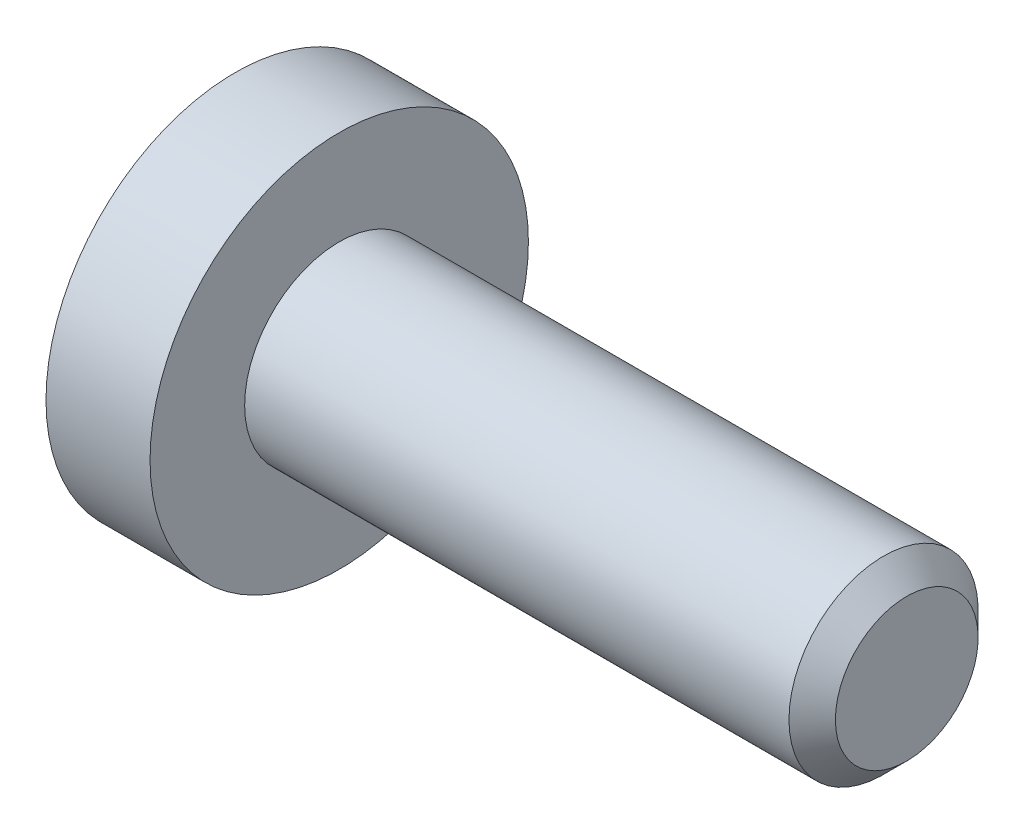
ISO-10303-21;
HEADER;
FILE_DESCRIPTION(('STEP AP214'),'2;1');
FILE_NAME('part.step','',(''),(''),'','','');
FILE_SCHEMA(('AUTOMOTIVE_DESIGN { 1 0 10303 214 1 1 1 1 }'));
ENDSEC;
DATA;
#1=APPLICATION_CONTEXT('core data for automotive mechanical design processes');
#2=APPLICATION_PROTOCOL_DEFINITION('international standard','automotive_design',2000,#1);
#3=PRODUCT_CONTEXT('',#1,'mechanical');
#4=PRODUCT('Part','Part','',(#3));
#5=PRODUCT_RELATED_PRODUCT_CATEGORY('part','',(#4));
#6=PRODUCT_DEFINITION_FORMATION('','',#4);
#7=PRODUCT_DEFINITION_CONTEXT('part definition',#1,'design');
#8=PRODUCT_DEFINITION('design','',#6,#7);
#9=PRODUCT_DEFINITION_SHAPE('','',#8);
#10=(LENGTH_UNIT() NAMED_UNIT(*) SI_UNIT(.MILLI.,.METRE.));
#11=(NAMED_UNIT(*) PLANE_ANGLE_UNIT() SI_UNIT($,.RADIAN.));
#12=(NAMED_UNIT(*) SI_UNIT($,.STERADIAN.) SOLID_ANGLE_UNIT());
#13=UNCERTAINTY_MEASURE_WITH_UNIT(LENGTH_MEASURE(1.E-05),#10,'distance_accuracy_value','');
#14=(GEOMETRIC_REPRESENTATION_CONTEXT(3) GLOBAL_UNCERTAINTY_ASSIGNED_CONTEXT((#13)) GLOBAL_UNIT_ASSIGNED_CONTEXT((#10,
#11,#12)) REPRESENTATION_CONTEXT('',''));
#15=CARTESIAN_POINT('',(0.,0.,0.));
#16=DIRECTION('',(0.,0.,1.));
#17=DIRECTION('',(1.,0.,0.));
#18=AXIS2_PLACEMENT_3D('',#15,#16,#17);
#19=CARTESIAN_POINT('',(-1.1,0.,0.));
#20=DIRECTION('',(1.,0.,0.));
#21=DIRECTION('',(0.,0.,-1.));
#22=AXIS2_PLACEMENT_3D('',#19,#20,#21);
#23=PLANE('',#22);
#24=CARTESIAN_POINT('',(-1.1,0.,0.));
#25=DIRECTION('',(-1.,0.,0.));
#26=DIRECTION('',(0.,0.,1.));
#27=AXIS2_PLACEMENT_3D('',#24,#25,#26);
#28=CIRCLE('',#27,2.);
#29=CARTESIAN_POINT('',(-1.1,0.,2.));
#30=VERTEX_POINT('',#29);
#31=EDGE_CURVE('E11',#30,#30,#28,.T.);
#32=ORIENTED_EDGE('',*,*,#31,.T.);
#33=EDGE_LOOP('',(#32));
#34=FACE_BOUND('',#33,.T.);
#35=DIRECTION('',(0.,-1.,0.));
#36=VECTOR('',#35,1.);
#37=CARTESIAN_POINT('',(-1.1,0.37527767497326,0.65));
#38=LINE('',#37,#36);
#39=CARTESIAN_POINT('',(-1.1,0.37527767497326,0.65));
#40=VERTEX_POINT('',#39);
#41=CARTESIAN_POINT('',(-1.1,-0.37527767497326,0.65));
#42=VERTEX_POINT('',#41);
#43=EDGE_CURVE('E52',#40,#42,#38,.T.);
#44=ORIENTED_EDGE('',*,*,#43,.T.);
#45=DIRECTION('',(0.,-0.499999999999993,-0.866025403784442));
#46=VECTOR('',#45,1.);
#47=CARTESIAN_POINT('',(-1.1,-0.37527767497326,0.65));
#48=LINE('',#47,#46);
#49=CARTESIAN_POINT('',(-1.1,-0.75055534994651,0.));
#50=VERTEX_POINT('',#49);
#51=EDGE_CURVE('E123',#42,#50,#48,.T.);
#52=ORIENTED_EDGE('',*,*,#51,.T.);
#53=DIRECTION('',(0.,0.499999999999993,-0.866025403784442));
#54=VECTOR('',#53,1.);
#55=CARTESIAN_POINT('',(-1.1,-0.75055534994651,0.));
#56=LINE('',#55,#54);
#57=CARTESIAN_POINT('',(-1.1,-0.37527767497326,-0.65));
#58=VERTEX_POINT('',#57);
#59=EDGE_CURVE('E126',#50,#58,#56,.T.);
#60=ORIENTED_EDGE('',*,*,#59,.T.);
#61=DIRECTION('',(0.,1.,0.));
#62=VECTOR('',#61,1.);
#63=CARTESIAN_POINT('',(-1.1,-0.37527767497326,-0.65));
#64=LINE('',#63,#62);
#65=CARTESIAN_POINT('',(-1.1,0.37527767497326,-0.65));
#66=VERTEX_POINT('',#65);
#67=EDGE_CURVE('E129',#58,#66,#64,.T.);
#68=ORIENTED_EDGE('',*,*,#67,.T.);
#69=DIRECTION('',(0.,0.499999999999993,0.866025403784442));
#70=VECTOR('',#69,1.);
#71=CARTESIAN_POINT('',(-1.1,0.37527767497326,-0.65));
#72=LINE('',#71,#70);
#73=CARTESIAN_POINT('',(-1.1,0.75055534994651,0.));
#74=VERTEX_POINT('',#73);
#75=EDGE_CURVE('E113',#66,#74,#72,.T.);
#76=ORIENTED_EDGE('',*,*,#75,.T.);
#77=DIRECTION('',(0.,-0.499999999999993,0.866025403784442));
#78=VECTOR('',#77,1.);
#79=CARTESIAN_POINT('',(-1.1,0.75055534994651,0.));
#80=LINE('',#79,#78);
#81=EDGE_CURVE('E132',#74,#40,#80,.T.);
#82=ORIENTED_EDGE('',*,*,#81,.T.);
#83=EDGE_LOOP('',(#44,#52,#60,#68,#76,#82));
#84=FACE_BOUND('',#83,.T.);
#85=ADVANCED_FACE('F38',(#34,#84),#23,.F.);
#86=CARTESIAN_POINT('',(6.,0.,0.));
#87=DIRECTION('',(-1.,0.,0.));
#88=DIRECTION('',(0.,0.,1.));
#89=AXIS2_PLACEMENT_3D('',#86,#87,#88);
#90=CYLINDRICAL_SURFACE('',#89,2.);
#91=ORIENTED_EDGE('',*,*,#31,.F.);
#92=EDGE_LOOP('',(#91));
#93=FACE_BOUND('',#92,.T.);
#94=CARTESIAN_POINT('',(0.,0.,0.));
#95=DIRECTION('',(-1.,0.,0.));
#96=DIRECTION('',(0.,0.,1.));
#97=AXIS2_PLACEMENT_3D('',#94,#95,#96);
#98=CIRCLE('',#97,2.);
#99=CARTESIAN_POINT('',(0.,0.,2.));
#100=VERTEX_POINT('',#99);
#101=EDGE_CURVE('E45',#100,#100,#98,.T.);
#102=ORIENTED_EDGE('',*,*,#101,.T.);
#103=EDGE_LOOP('',(#102));
#104=FACE_BOUND('',#103,.T.);
#105=ADVANCED_FACE('F154',(#93,#104),#90,.T.);
#106=CARTESIAN_POINT('',(0.,2.,0.));
#107=DIRECTION('',(-1.,0.,0.));
#108=DIRECTION('',(0.,0.,1.));
#109=AXIS2_PLACEMENT_3D('',#106,#107,#108);
#110=PLANE('',#109);
#111=ORIENTED_EDGE('',*,*,#101,.F.);
#112=EDGE_LOOP('',(#111));
#113=FACE_BOUND('',#112,.T.);
#114=CARTESIAN_POINT('',(0.,0.,0.));
#115=DIRECTION('',(-1.,0.,0.));
#116=DIRECTION('',(0.,0.,1.));
#117=AXIS2_PLACEMENT_3D('',#114,#115,#116);
#118=CIRCLE('',#117,1.);
#119=CARTESIAN_POINT('',(0.,0.,1.));
#120=VERTEX_POINT('',#119);
#121=EDGE_CURVE('E149',#120,#120,#118,.T.);
#122=ORIENTED_EDGE('',*,*,#121,.T.);
#123=EDGE_LOOP('',(#122));
#124=FACE_BOUND('',#123,.T.);
#125=ADVANCED_FACE('F156',(#113,#124),#110,.F.);
#126=CARTESIAN_POINT('',(6.,0.,0.));
#127=DIRECTION('',(-1.,0.,0.));
#128=DIRECTION('',(0.,0.,1.));
#129=AXIS2_PLACEMENT_3D('',#126,#127,#128);
#130=CYLINDRICAL_SURFACE('',#129,1.);
#131=ORIENTED_EDGE('',*,*,#121,.F.);
#132=EDGE_LOOP('',(#131));
#133=FACE_BOUND('',#132,.T.);
#134=CARTESIAN_POINT('',(5.7545,0.,0.));
#135=DIRECTION('',(-1.,0.,0.));
#136=DIRECTION('',(0.,0.,1.));
#137=AXIS2_PLACEMENT_3D('',#134,#135,#136);
#138=CIRCLE('',#137,1.);
#139=CARTESIAN_POINT('',(5.7545,0.,1.));
#140=VERTEX_POINT('',#139);
#141=EDGE_CURVE('E146',#140,#140,#138,.T.);
#142=ORIENTED_EDGE('',*,*,#141,.T.);
#143=EDGE_LOOP('',(#142));
#144=FACE_BOUND('',#143,.T.);
#145=ADVANCED_FACE('F159',(#133,#144),#130,.T.);
#146=CARTESIAN_POINT('',(6.,0.,0.));
#147=DIRECTION('',(-1.,0.,0.));
#148=DIRECTION('',(0.,0.,1.));
#149=AXIS2_PLACEMENT_3D('',#146,#147,#148);
#150=CONICAL_SURFACE('',#149,0.7545,0.785398163397448);
#151=ORIENTED_EDGE('',*,*,#141,.F.);
#152=EDGE_LOOP('',(#151));
#153=FACE_BOUND('',#152,.T.);
#154=CARTESIAN_POINT('',(6.,0.,0.));
#155=DIRECTION('',(-1.,0.,0.));
#156=DIRECTION('',(0.,0.,1.));
#157=AXIS2_PLACEMENT_3D('',#154,#155,#156);
#158=CIRCLE('',#157,0.7545);
#159=CARTESIAN_POINT('',(6.,0.,0.7545));
#160=VERTEX_POINT('',#159);
#161=EDGE_CURVE('E143',#160,#160,#158,.T.);
#162=ORIENTED_EDGE('',*,*,#161,.T.);
#163=EDGE_LOOP('',(#162));
#164=FACE_BOUND('',#163,.T.);
#165=ADVANCED_FACE('F165',(#153,#164),#150,.T.);
#166=CARTESIAN_POINT('',(6.,0.7545,0.));
#167=DIRECTION('',(-1.,0.,0.));
#168=DIRECTION('',(0.,0.,1.));
#169=AXIS2_PLACEMENT_3D('',#166,#167,#168);
#170=PLANE('',#169);
#171=ORIENTED_EDGE('',*,*,#161,.F.);
#172=EDGE_LOOP('',(#171));
#173=FACE_BOUND('',#172,.T.);
#174=ADVANCED_FACE('F171',(#173),#170,.F.);
#175=CARTESIAN_POINT('',(0.0999999999999998,0.37527767497326,0.65));
#176=DIRECTION('',(0.,0.,-1.));
#177=DIRECTION('',(-1.,0.,0.));
#178=AXIS2_PLACEMENT_3D('',#175,#176,#177);
#179=PLANE('',#178);
#180=ORIENTED_EDGE('',*,*,#43,.F.);
#181=DIRECTION('',(-1.,0.,0.));
#182=VECTOR('',#181,1.);
#183=CARTESIAN_POINT('',(0.0999999999999998,0.37527767497326,0.65));
#184=LINE('',#183,#182);
#185=CARTESIAN_POINT('',(0.0999999999999998,0.37527767497326,0.65));
#186=VERTEX_POINT('',#185);
#187=EDGE_CURVE('E118',#186,#40,#184,.T.);
#188=ORIENTED_EDGE('',*,*,#187,.F.);
#189=DIRECTION('',(0.,-1.,0.));
#190=VECTOR('',#189,1.);
#191=CARTESIAN_POINT('',(0.0999999999999998,0.37527767497326,0.65));
#192=LINE('',#191,#190);
#193=CARTESIAN_POINT('',(0.0999999999999998,-0.37527767497326,0.65));
#194=VERTEX_POINT('',#193);
#195=EDGE_CURVE('E135',#186,#194,#192,.T.);
#196=ORIENTED_EDGE('',*,*,#195,.T.);
#197=DIRECTION('',(-1.,0.,0.));
#198=VECTOR('',#197,1.);
#199=CARTESIAN_POINT('',(0.0999999999999998,-0.37527767497326,0.65));
#200=LINE('',#199,#198);
#201=EDGE_CURVE('E141',#194,#42,#200,.T.);
#202=ORIENTED_EDGE('',*,*,#201,.T.);
#203=EDGE_LOOP('',(#180,#188,#196,#202));
#204=FACE_BOUND('',#203,.T.);
#205=ADVANCED_FACE('F176',(#204),#179,.T.);
#206=CARTESIAN_POINT('',(0.0999999999999998,-0.37527767497326,0.65));
#207=DIRECTION('',(0.,0.866025403784443,-0.499999999999993));
#208=DIRECTION('',(0.,0.499999999999993,0.866025403784442));
#209=AXIS2_PLACEMENT_3D('',#206,#207,#208);
#210=PLANE('',#209);
#211=ORIENTED_EDGE('',*,*,#51,.F.);
#212=ORIENTED_EDGE('',*,*,#201,.F.);
#213=DIRECTION('',(0.,-0.499999999999993,-0.866025403784442));
#214=VECTOR('',#213,1.);
#215=CARTESIAN_POINT('',(0.0999999999999998,-0.37527767497326,0.65));
#216=LINE('',#215,#214);
#217=CARTESIAN_POINT('',(0.0999999999999998,-0.75055534994651,0.));
#218=VERTEX_POINT('',#217);
#219=EDGE_CURVE('E91',#194,#218,#216,.T.);
#220=ORIENTED_EDGE('',*,*,#219,.T.);
#221=DIRECTION('',(-1.,0.,0.));
#222=VECTOR('',#221,1.);
#223=CARTESIAN_POINT('',(0.0999999999999998,-0.75055534994651,0.));
#224=LINE('',#223,#222);
#225=EDGE_CURVE('E139',#218,#50,#224,.T.);
#226=ORIENTED_EDGE('',*,*,#225,.T.);
#227=EDGE_LOOP('',(#211,#212,#220,#226));
#228=FACE_BOUND('',#227,.T.);
#229=ADVANCED_FACE('F181',(#228),#210,.T.);
#230=CARTESIAN_POINT('',(0.0999999999999998,-0.75055534994651,0.));
#231=DIRECTION('',(0.,0.866025403784443,0.499999999999993));
#232=DIRECTION('',(0.,-0.499999999999993,0.866025403784442));
#233=AXIS2_PLACEMENT_3D('',#230,#231,#232);
#234=PLANE('',#233);
#235=ORIENTED_EDGE('',*,*,#59,.F.);
#236=ORIENTED_EDGE('',*,*,#225,.F.);
#237=DIRECTION('',(0.,0.499999999999993,-0.866025403784442));
#238=VECTOR('',#237,1.);
#239=CARTESIAN_POINT('',(0.0999999999999998,-0.75055534994651,0.));
#240=LINE('',#239,#238);
#241=CARTESIAN_POINT('',(0.0999999999999998,-0.37527767497326,-0.65));
#242=VERTEX_POINT('',#241);
#243=EDGE_CURVE('E109',#218,#242,#240,.T.);
#244=ORIENTED_EDGE('',*,*,#243,.T.);
#245=DIRECTION('',(-1.,0.,0.));
#246=VECTOR('',#245,1.);
#247=CARTESIAN_POINT('',(0.0999999999999998,-0.37527767497326,-0.65));
#248=LINE('',#247,#246);
#249=EDGE_CURVE('E106',#242,#58,#248,.T.);
#250=ORIENTED_EDGE('',*,*,#249,.T.);
#251=EDGE_LOOP('',(#235,#236,#244,#250));
#252=FACE_BOUND('',#251,.T.);
#253=ADVANCED_FACE('F198',(#252),#234,.T.);
#254=CARTESIAN_POINT('',(0.0999999999999998,-0.37527767497326,-0.65));
#255=DIRECTION('',(0.,0.,1.));
#256=DIRECTION('',(1.,0.,0.));
#257=AXIS2_PLACEMENT_3D('',#254,#255,#256);
#258=PLANE('',#257);
#259=ORIENTED_EDGE('',*,*,#67,.F.);
#260=ORIENTED_EDGE('',*,*,#249,.F.);
#261=DIRECTION('',(0.,1.,0.));
#262=VECTOR('',#261,1.);
#263=CARTESIAN_POINT('',(0.0999999999999998,-0.37527767497326,-0.65));
#264=LINE('',#263,#262);
#265=CARTESIAN_POINT('',(0.0999999999999998,0.37527767497326,-0.65));
#266=VERTEX_POINT('',#265);
#267=EDGE_CURVE('E101',#242,#266,#264,.T.);
#268=ORIENTED_EDGE('',*,*,#267,.T.);
#269=DIRECTION('',(-1.,0.,0.));
#270=VECTOR('',#269,1.);
#271=CARTESIAN_POINT('',(0.0999999999999998,0.37527767497326,-0.65));
#272=LINE('',#271,#270);
#273=EDGE_CURVE('E105',#266,#66,#272,.T.);
#274=ORIENTED_EDGE('',*,*,#273,.T.);
#275=EDGE_LOOP('',(#259,#260,#268,#274));
#276=FACE_BOUND('',#275,.T.);
#277=ADVANCED_FACE('F104',(#276),#258,.T.);
#278=CARTESIAN_POINT('',(0.0999999999999998,0.37527767497326,-0.65));
#279=DIRECTION('',(0.,-0.866025403784443,0.499999999999993));
#280=DIRECTION('',(0.,-0.499999999999993,-0.866025403784442));
#281=AXIS2_PLACEMENT_3D('',#278,#279,#280);
#282=PLANE('',#281);
#283=ORIENTED_EDGE('',*,*,#75,.F.);
#284=ORIENTED_EDGE('',*,*,#273,.F.);
#285=DIRECTION('',(0.,0.499999999999993,0.866025403784442));
#286=VECTOR('',#285,1.);
#287=CARTESIAN_POINT('',(0.0999999999999998,0.37527767497326,-0.65));
#288=LINE('',#287,#286);
#289=CARTESIAN_POINT('',(0.0999999999999998,0.75055534994651,0.));
#290=VERTEX_POINT('',#289);
#291=EDGE_CURVE('E108',#266,#290,#288,.T.);
#292=ORIENTED_EDGE('',*,*,#291,.T.);
#293=DIRECTION('',(-1.,0.,0.));
#294=VECTOR('',#293,1.);
#295=CARTESIAN_POINT('',(0.0999999999999998,0.75055534994651,0.));
#296=LINE('',#295,#294);
#297=EDGE_CURVE('E82',#290,#74,#296,.T.);
#298=ORIENTED_EDGE('',*,*,#297,.T.);
#299=EDGE_LOOP('',(#283,#284,#292,#298));
#300=FACE_BOUND('',#299,.T.);
#301=ADVANCED_FACE('F111',(#300),#282,.T.);
#302=CARTESIAN_POINT('',(0.0999999999999998,0.75055534994651,0.));
#303=DIRECTION('',(0.,-0.866025403784443,-0.499999999999993));
#304=DIRECTION('',(0.,0.499999999999993,-0.866025403784442));
#305=AXIS2_PLACEMENT_3D('',#302,#303,#304);
#306=PLANE('',#305);
#307=ORIENTED_EDGE('',*,*,#81,.F.);
#308=ORIENTED_EDGE('',*,*,#297,.F.);
#309=DIRECTION('',(0.,-0.499999999999993,0.866025403784442));
#310=VECTOR('',#309,1.);
#311=CARTESIAN_POINT('',(0.0999999999999998,0.75055534994651,0.));
#312=LINE('',#311,#310);
#313=EDGE_CURVE('E60',#290,#186,#312,.T.);
#314=ORIENTED_EDGE('',*,*,#313,.T.);
#315=ORIENTED_EDGE('',*,*,#187,.T.);
#316=EDGE_LOOP('',(#307,#308,#314,#315));
#317=FACE_BOUND('',#316,.T.);
#318=ADVANCED_FACE('F191',(#317),#306,.T.);
#319=CARTESIAN_POINT('',(0.0999999999999998,0.,0.));
#320=DIRECTION('',(1.,0.,0.));
#321=DIRECTION('',(0.,0.,-1.));
#322=AXIS2_PLACEMENT_3D('',#319,#320,#321);
#323=PLANE('',#322);
#324=ORIENTED_EDGE('',*,*,#195,.F.);
#325=ORIENTED_EDGE('',*,*,#313,.F.);
#326=ORIENTED_EDGE('',*,*,#291,.F.);
#327=ORIENTED_EDGE('',*,*,#267,.F.);
#328=ORIENTED_EDGE('',*,*,#243,.F.);
#329=ORIENTED_EDGE('',*,*,#219,.F.);
#330=EDGE_LOOP('',(#324,#325,#326,#327,#328,#329));
#331=FACE_BOUND('',#330,.T.);
#332=ADVANCED_FACE('F116',(#331),#323,.F.);
#333=CLOSED_SHELL('',(#85,#105,#125,#145,#165,#174,#205,#229,#253,#277,#301,#318,#332));
#334=MANIFOLD_SOLID_BREP('B2',#333);
#335=ADVANCED_BREP_SHAPE_REPRESENTATION('',(#18,#334),#14);
#336=SHAPE_DEFINITION_REPRESENTATION(#9,#335);
ENDSEC;
END-ISO-10303-21;
